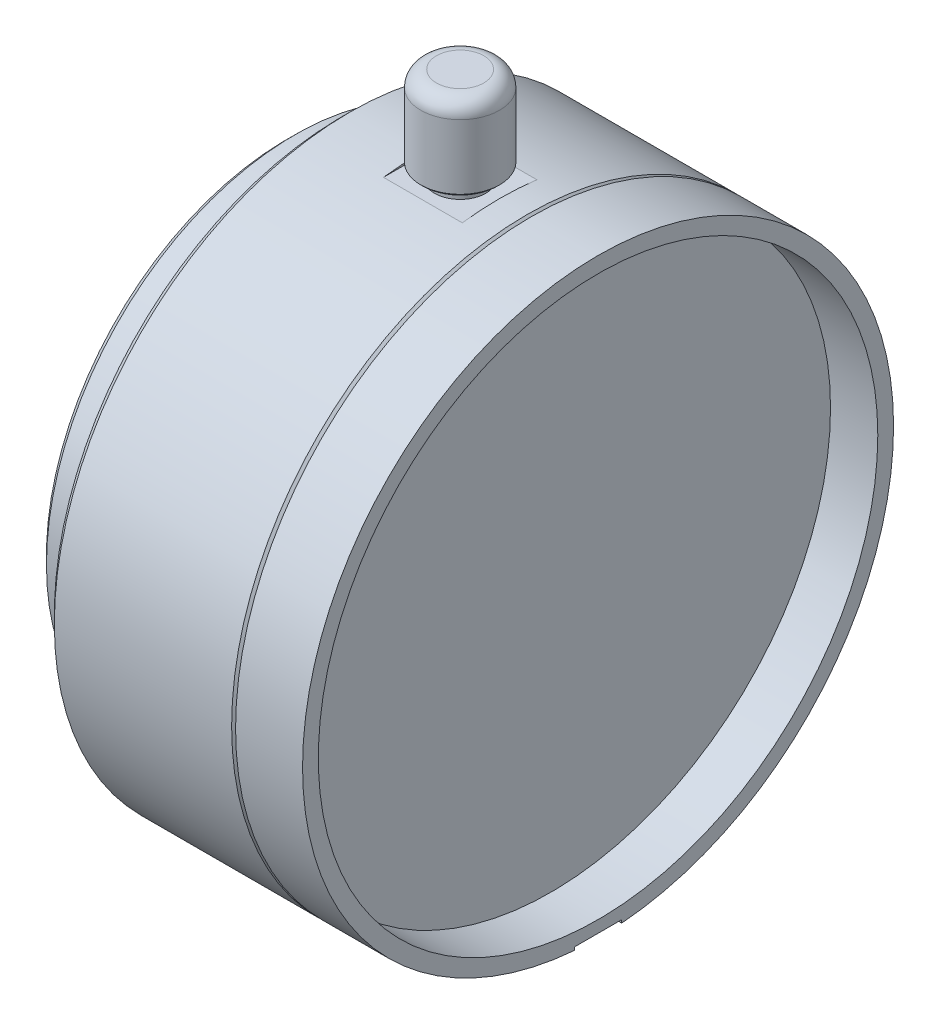
ISO-10303-21;
HEADER;
FILE_DESCRIPTION(('STEP AP214'),'2;1');
FILE_NAME('part.step','',(''),(''),'','','');
FILE_SCHEMA(('AUTOMOTIVE_DESIGN { 1 0 10303 214 1 1 1 1 }'));
ENDSEC;
DATA;
#1=APPLICATION_CONTEXT('core data for automotive mechanical design processes');
#2=APPLICATION_PROTOCOL_DEFINITION('international standard','automotive_design',2000,#1);
#3=PRODUCT_CONTEXT('',#1,'mechanical');
#4=PRODUCT('Part','Part','',(#3));
#5=PRODUCT_RELATED_PRODUCT_CATEGORY('part','',(#4));
#6=PRODUCT_DEFINITION_FORMATION('','',#4);
#7=PRODUCT_DEFINITION_CONTEXT('part definition',#1,'design');
#8=PRODUCT_DEFINITION('design','',#6,#7);
#9=PRODUCT_DEFINITION_SHAPE('','',#8);
#10=(LENGTH_UNIT() NAMED_UNIT(*) SI_UNIT(.MILLI.,.METRE.));
#11=(NAMED_UNIT(*) PLANE_ANGLE_UNIT() SI_UNIT($,.RADIAN.));
#12=(NAMED_UNIT(*) SI_UNIT($,.STERADIAN.) SOLID_ANGLE_UNIT());
#13=UNCERTAINTY_MEASURE_WITH_UNIT(LENGTH_MEASURE(1.E-05),#10,'distance_accuracy_value','');
#14=(GEOMETRIC_REPRESENTATION_CONTEXT(3) GLOBAL_UNCERTAINTY_ASSIGNED_CONTEXT((#13)) GLOBAL_UNIT_ASSIGNED_CONTEXT((#10,
#11,#12)) REPRESENTATION_CONTEXT('',''));
#15=CARTESIAN_POINT('',(0.,0.,0.));
#16=DIRECTION('',(0.,0.,1.));
#17=DIRECTION('',(1.,0.,0.));
#18=AXIS2_PLACEMENT_3D('',#15,#16,#17);
#19=CARTESIAN_POINT('',(3.,0.,0.));
#20=DIRECTION('',(-1.,0.,0.));
#21=DIRECTION('',(0.,0.,1.));
#22=AXIS2_PLACEMENT_3D('',#19,#20,#21);
#23=PLANE('',#22);
#24=CARTESIAN_POINT('',(3.,0.,0.));
#25=DIRECTION('',(-1.,0.,0.));
#26=DIRECTION('',(0.,0.,1.));
#27=AXIS2_PLACEMENT_3D('',#24,#25,#26);
#28=CIRCLE('',#27,15.75);
#29=CARTESIAN_POINT('',(3.,0.,15.75));
#30=VERTEX_POINT('',#29);
#31=EDGE_CURVE('E19',#30,#30,#28,.T.);
#32=ORIENTED_EDGE('',*,*,#31,.T.);
#33=EDGE_LOOP('',(#32));
#34=FACE_BOUND('',#33,.T.);
#35=ADVANCED_FACE('F16',(#34),#23,.T.);
#36=CARTESIAN_POINT('',(3.,25.,0.));
#37=DIRECTION('',(-1.,0.,0.));
#38=DIRECTION('',(0.,0.,1.));
#39=AXIS2_PLACEMENT_3D('',#36,#37,#38);
#40=PLANE('',#39);
#41=CARTESIAN_POINT('',(3.,25.,0.));
#42=DIRECTION('',(-1.,0.,0.));
#43=DIRECTION('',(0.,0.,1.));
#44=AXIS2_PLACEMENT_3D('',#41,#42,#43);
#45=CIRCLE('',#44,3.00000000000001);
#46=CARTESIAN_POINT('',(3.,25.,3.00000000000001));
#47=VERTEX_POINT('',#46);
#48=EDGE_CURVE('E329',#47,#47,#45,.T.);
#49=ORIENTED_EDGE('',*,*,#48,.T.);
#50=EDGE_LOOP('',(#49));
#51=FACE_BOUND('',#50,.T.);
#52=ADVANCED_FACE('F407',(#51),#40,.T.);
#53=CARTESIAN_POINT('',(19.,49.2,0.));
#54=DIRECTION('',(0.,1.,0.));
#55=DIRECTION('',(0.,0.,1.));
#56=AXIS2_PLACEMENT_3D('',#53,#54,#55);
#57=PLANE('',#56);
#58=CARTESIAN_POINT('',(19.,49.2,0.));
#59=DIRECTION('',(0.,-1.,0.));
#60=DIRECTION('',(0.972491776211941,0.,0.232937212999866));
#61=AXIS2_PLACEMENT_3D('',#58,#59,#60);
#62=CIRCLE('',#61,3.);
#63=CARTESIAN_POINT('',(21.9174753286358,49.2,0.698811638999596));
#64=VERTEX_POINT('',#63);
#65=EDGE_CURVE('E125',#64,#64,#62,.T.);
#66=ORIENTED_EDGE('',*,*,#65,.F.);
#67=EDGE_LOOP('',(#66));
#68=FACE_BOUND('',#67,.T.);
#69=ADVANCED_FACE('F341',(#68),#57,.T.);
#70=CARTESIAN_POINT('',(3.,0.,0.));
#71=DIRECTION('',(-1.,0.,0.));
#72=DIRECTION('',(0.,0.,1.));
#73=AXIS2_PLACEMENT_3D('',#70,#71,#72);
#74=CYLINDRICAL_SURFACE('',#73,15.75);
#75=ORIENTED_EDGE('',*,*,#31,.F.);
#76=EDGE_LOOP('',(#75));
#77=FACE_BOUND('',#76,.T.);
#78=CARTESIAN_POINT('',(-2.00000000000003,0.,0.));
#79=DIRECTION('',(-1.,0.,0.));
#80=DIRECTION('',(0.,0.,1.));
#81=AXIS2_PLACEMENT_3D('',#78,#79,#80);
#82=CIRCLE('',#81,15.75);
#83=CARTESIAN_POINT('',(-2.00000000000003,0.,15.75));
#84=VERTEX_POINT('',#83);
#85=EDGE_CURVE('E121',#84,#84,#82,.T.);
#86=ORIENTED_EDGE('',*,*,#85,.T.);
#87=EDGE_LOOP('',(#86));
#88=FACE_BOUND('',#87,.T.);
#89=ADVANCED_FACE('F337',(#77,#88),#74,.F.);
#90=CARTESIAN_POINT('',(5.,17.6776695296638,-17.6776695296636));
#91=DIRECTION('',(-1.,0.,0.));
#92=DIRECTION('',(0.,0.,1.));
#93=AXIS2_PLACEMENT_3D('',#90,#91,#92);
#94=PLANE('',#93);
#95=CARTESIAN_POINT('',(5.,17.6776695296638,-17.6776695296636));
#96=DIRECTION('',(-1.,0.,0.));
#97=DIRECTION('',(0.,0.,1.));
#98=AXIS2_PLACEMENT_3D('',#95,#96,#97);
#99=CIRCLE('',#98,2.5);
#100=CARTESIAN_POINT('',(5.,17.6776695296638,-15.1776695296636));
#101=VERTEX_POINT('',#100);
#102=EDGE_CURVE('E124',#101,#101,#99,.T.);
#103=ORIENTED_EDGE('',*,*,#102,.T.);
#104=EDGE_LOOP('',(#103));
#105=FACE_BOUND('',#104,.T.);
#106=ADVANCED_FACE('F340',(#105),#94,.T.);
#107=CARTESIAN_POINT('',(5.,-17.6776695296637,-17.6776695296637));
#108=DIRECTION('',(-1.,0.,0.));
#109=DIRECTION('',(0.,0.,1.));
#110=AXIS2_PLACEMENT_3D('',#107,#108,#109);
#111=PLANE('',#110);
#112=CARTESIAN_POINT('',(5.,-17.6776695296637,-17.6776695296637));
#113=DIRECTION('',(-1.,0.,0.));
#114=DIRECTION('',(0.,0.,1.));
#115=AXIS2_PLACEMENT_3D('',#112,#113,#114);
#116=CIRCLE('',#115,2.5);
#117=CARTESIAN_POINT('',(5.,-17.6776695296637,-15.1776695296637));
#118=VERTEX_POINT('',#117);
#119=EDGE_CURVE('E325',#118,#118,#116,.T.);
#120=ORIENTED_EDGE('',*,*,#119,.T.);
#121=EDGE_LOOP('',(#120));
#122=FACE_BOUND('',#121,.T.);
#123=ADVANCED_FACE('F395',(#122),#111,.T.);
#124=CARTESIAN_POINT('',(5.,-17.6776695296638,17.6776695296636));
#125=DIRECTION('',(-1.,0.,0.));
#126=DIRECTION('',(0.,0.,1.));
#127=AXIS2_PLACEMENT_3D('',#124,#125,#126);
#128=PLANE('',#127);
#129=CARTESIAN_POINT('',(5.,-17.6776695296638,17.6776695296636));
#130=DIRECTION('',(-1.,0.,0.));
#131=DIRECTION('',(0.,0.,1.));
#132=AXIS2_PLACEMENT_3D('',#129,#130,#131);
#133=CIRCLE('',#132,2.5);
#134=CARTESIAN_POINT('',(5.,-17.6776695296638,20.1776695296636));
#135=VERTEX_POINT('',#134);
#136=EDGE_CURVE('E322',#135,#135,#133,.T.);
#137=ORIENTED_EDGE('',*,*,#136,.T.);
#138=EDGE_LOOP('',(#137));
#139=FACE_BOUND('',#138,.T.);
#140=ADVANCED_FACE('F400',(#139),#128,.T.);
#141=CARTESIAN_POINT('',(5.,17.6776695296638,17.6776695296636));
#142=DIRECTION('',(-1.,0.,0.));
#143=DIRECTION('',(0.,0.,1.));
#144=AXIS2_PLACEMENT_3D('',#141,#142,#143);
#145=PLANE('',#144);
#146=CARTESIAN_POINT('',(5.,17.6776695296638,17.6776695296636));
#147=DIRECTION('',(-1.,0.,0.));
#148=DIRECTION('',(0.,0.,1.));
#149=AXIS2_PLACEMENT_3D('',#146,#147,#148);
#150=CIRCLE('',#149,2.5);
#151=CARTESIAN_POINT('',(5.,17.6776695296638,20.1776695296636));
#152=VERTEX_POINT('',#151);
#153=EDGE_CURVE('E118',#152,#152,#150,.T.);
#154=ORIENTED_EDGE('',*,*,#153,.T.);
#155=EDGE_LOOP('',(#154));
#156=FACE_BOUND('',#155,.T.);
#157=ADVANCED_FACE('F470',(#156),#145,.T.);
#158=CARTESIAN_POINT('',(3.,25.,0.));
#159=DIRECTION('',(-1.,0.,0.));
#160=DIRECTION('',(0.,0.,1.));
#161=AXIS2_PLACEMENT_3D('',#158,#159,#160);
#162=CYLINDRICAL_SURFACE('',#161,3.00000000000001);
#163=ORIENTED_EDGE('',*,*,#48,.F.);
#164=EDGE_LOOP('',(#163));
#165=FACE_BOUND('',#164,.T.);
#166=CARTESIAN_POINT('',(-2.49999999999773,25.,0.));
#167=DIRECTION('',(-1.,0.,0.));
#168=DIRECTION('',(0.,0.,1.));
#169=AXIS2_PLACEMENT_3D('',#166,#167,#168);
#170=CIRCLE('',#169,2.9999999999859);
#171=CARTESIAN_POINT('',(-2.49999999999773,25.,2.9999999999859));
#172=VERTEX_POINT('',#171);
#173=EDGE_CURVE('E115',#172,#172,#170,.T.);
#174=ORIENTED_EDGE('',*,*,#173,.T.);
#175=EDGE_LOOP('',(#174));
#176=FACE_BOUND('',#175,.T.);
#177=ADVANCED_FACE('F479',(#165,#176),#162,.F.);
#178=CARTESIAN_POINT('',(30.5,0.,0.));
#179=DIRECTION('',(1.,0.,0.));
#180=DIRECTION('',(0.,0.,-1.));
#181=AXIS2_PLACEMENT_3D('',#178,#179,#180);
#182=PLANE('',#181);
#183=CARTESIAN_POINT('',(30.5,0.,0.));
#184=DIRECTION('',(1.,0.,0.));
#185=DIRECTION('',(0.,0.,-1.));
#186=AXIS2_PLACEMENT_3D('',#183,#184,#185);
#187=CIRCLE('',#186,35.5);
#188=CARTESIAN_POINT('',(30.5,0.,-35.5));
#189=VERTEX_POINT('',#188);
#190=EDGE_CURVE('E104',#189,#189,#187,.T.);
#191=ORIENTED_EDGE('',*,*,#190,.T.);
#192=EDGE_LOOP('',(#191));
#193=FACE_BOUND('',#192,.T.);
#194=ADVANCED_FACE('F139',(#193),#182,.T.);
#195=CARTESIAN_POINT('',(19.,47.2,0.));
#196=DIRECTION('',(0.,1.,0.));
#197=DIRECTION('',(0.972491776211941,0.,0.232937212999866));
#198=AXIS2_PLACEMENT_3D('',#195,#196,#197);
#199=TOROIDAL_SURFACE('',#198,3.,2.);
#200=ORIENTED_EDGE('',*,*,#65,.T.);
#201=EDGE_LOOP('',(#200));
#202=FACE_BOUND('',#201,.T.);
#203=CARTESIAN_POINT('',(19.,47.2,0.));
#204=DIRECTION('',(0.,-1.,0.));
#205=DIRECTION('',(0.,0.,-1.));
#206=AXIS2_PLACEMENT_3D('',#203,#204,#205);
#207=CIRCLE('',#206,5.);
#208=CARTESIAN_POINT('',(19.,47.2,-5.));
#209=VERTEX_POINT('',#208);
#210=EDGE_CURVE('E100',#209,#209,#207,.T.);
#211=ORIENTED_EDGE('',*,*,#210,.F.);
#212=EDGE_LOOP('',(#211));
#213=FACE_BOUND('',#212,.T.);
#214=ADVANCED_FACE('F133',(#202,#213),#199,.T.);
#215=CARTESIAN_POINT('',(-3.,0.,0.));
#216=DIRECTION('',(-1.,0.,0.));
#217=DIRECTION('',(0.,0.,1.));
#218=AXIS2_PLACEMENT_3D('',#215,#216,#217);
#219=CONICAL_SURFACE('',#218,16.75,0.785398163397455);
#220=ORIENTED_EDGE('',*,*,#85,.F.);
#221=EDGE_LOOP('',(#220));
#222=FACE_BOUND('',#221,.T.);
#223=CARTESIAN_POINT('',(-3.,0.,0.));
#224=DIRECTION('',(-1.,0.,0.));
#225=DIRECTION('',(0.,0.,1.));
#226=AXIS2_PLACEMENT_3D('',#223,#224,#225);
#227=CIRCLE('',#226,16.75);
#228=CARTESIAN_POINT('',(-3.,0.,16.75));
#229=VERTEX_POINT('',#228);
#230=EDGE_CURVE('E103',#229,#229,#227,.T.);
#231=ORIENTED_EDGE('',*,*,#230,.T.);
#232=EDGE_LOOP('',(#231));
#233=FACE_BOUND('',#232,.T.);
#234=ADVANCED_FACE('F138',(#222,#233),#219,.F.);
#235=CARTESIAN_POINT('',(-3.,17.6776695296638,-17.6776695296636));
#236=DIRECTION('',(-1.,0.,0.));
#237=DIRECTION('',(0.,0.,1.));
#238=AXIS2_PLACEMENT_3D('',#235,#236,#237);
#239=CYLINDRICAL_SURFACE('',#238,2.5);
#240=CARTESIAN_POINT('',(-3.,17.6776695296638,-17.6776695296636));
#241=DIRECTION('',(-1.,0.,0.));
#242=DIRECTION('',(0.,0.,1.));
#243=AXIS2_PLACEMENT_3D('',#240,#241,#242);
#244=CIRCLE('',#243,2.5);
#245=CARTESIAN_POINT('',(-3.,17.6776695296638,-15.1776695296636));
#246=VERTEX_POINT('',#245);
#247=EDGE_CURVE('E313',#246,#246,#244,.T.);
#248=ORIENTED_EDGE('',*,*,#247,.T.);
#249=EDGE_LOOP('',(#248));
#250=FACE_BOUND('',#249,.T.);
#251=ORIENTED_EDGE('',*,*,#102,.F.);
#252=EDGE_LOOP('',(#251));
#253=FACE_BOUND('',#252,.T.);
#254=ADVANCED_FACE('F347',(#250,#253),#239,.F.);
#255=CARTESIAN_POINT('',(-3.,-17.6776695296637,-17.6776695296637));
#256=DIRECTION('',(-1.,0.,0.));
#257=DIRECTION('',(0.,0.,1.));
#258=AXIS2_PLACEMENT_3D('',#255,#256,#257);
#259=CYLINDRICAL_SURFACE('',#258,2.5);
#260=CARTESIAN_POINT('',(-3.,-17.6776695296637,-17.6776695296637));
#261=DIRECTION('',(-1.,0.,0.));
#262=DIRECTION('',(0.,0.,1.));
#263=AXIS2_PLACEMENT_3D('',#260,#261,#262);
#264=CIRCLE('',#263,2.5);
#265=CARTESIAN_POINT('',(-3.,-17.6776695296637,-15.1776695296637));
#266=VERTEX_POINT('',#265);
#267=EDGE_CURVE('E310',#266,#266,#264,.T.);
#268=ORIENTED_EDGE('',*,*,#267,.T.);
#269=EDGE_LOOP('',(#268));
#270=FACE_BOUND('',#269,.T.);
#271=ORIENTED_EDGE('',*,*,#119,.F.);
#272=EDGE_LOOP('',(#271));
#273=FACE_BOUND('',#272,.T.);
#274=ADVANCED_FACE('F382',(#270,#273),#259,.F.);
#275=CARTESIAN_POINT('',(-3.,-17.6776695296638,17.6776695296636));
#276=DIRECTION('',(-1.,0.,0.));
#277=DIRECTION('',(0.,0.,1.));
#278=AXIS2_PLACEMENT_3D('',#275,#276,#277);
#279=CYLINDRICAL_SURFACE('',#278,2.5);
#280=CARTESIAN_POINT('',(-3.,-17.6776695296638,17.6776695296636));
#281=DIRECTION('',(-1.,0.,0.));
#282=DIRECTION('',(0.,0.,1.));
#283=AXIS2_PLACEMENT_3D('',#280,#281,#282);
#284=CIRCLE('',#283,2.5);
#285=CARTESIAN_POINT('',(-3.,-17.6776695296638,20.1776695296636));
#286=VERTEX_POINT('',#285);
#287=EDGE_CURVE('E307',#286,#286,#284,.T.);
#288=ORIENTED_EDGE('',*,*,#287,.T.);
#289=EDGE_LOOP('',(#288));
#290=FACE_BOUND('',#289,.T.);
#291=ORIENTED_EDGE('',*,*,#136,.F.);
#292=EDGE_LOOP('',(#291));
#293=FACE_BOUND('',#292,.T.);
#294=ADVANCED_FACE('F378',(#290,#293),#279,.F.);
#295=CARTESIAN_POINT('',(-3.,17.6776695296638,17.6776695296636));
#296=DIRECTION('',(-1.,0.,0.));
#297=DIRECTION('',(0.,0.,1.));
#298=AXIS2_PLACEMENT_3D('',#295,#296,#297);
#299=CYLINDRICAL_SURFACE('',#298,2.5);
#300=CARTESIAN_POINT('',(-3.,17.6776695296638,17.6776695296636));
#301=DIRECTION('',(-1.,0.,0.));
#302=DIRECTION('',(0.,0.,1.));
#303=AXIS2_PLACEMENT_3D('',#300,#301,#302);
#304=CIRCLE('',#303,2.5);
#305=CARTESIAN_POINT('',(-3.,17.6776695296638,20.1776695296636));
#306=VERTEX_POINT('',#305);
#307=EDGE_CURVE('E304',#306,#306,#304,.T.);
#308=ORIENTED_EDGE('',*,*,#307,.T.);
#309=EDGE_LOOP('',(#308));
#310=FACE_BOUND('',#309,.T.);
#311=ORIENTED_EDGE('',*,*,#153,.F.);
#312=EDGE_LOOP('',(#311));
#313=FACE_BOUND('',#312,.T.);
#314=ADVANCED_FACE('F374',(#310,#313),#299,.F.);
#315=CARTESIAN_POINT('',(-2.99999999987222,25.,0.));
#316=DIRECTION('',(-1.,0.,0.));
#317=DIRECTION('',(0.,-1.,0.));
#318=AXIS2_PLACEMENT_3D('',#315,#316,#317);
#319=CONICAL_SURFACE('',#318,3.49999999986039,0.785398163454292);
#320=ORIENTED_EDGE('',*,*,#173,.F.);
#321=EDGE_LOOP('',(#320));
#322=FACE_BOUND('',#321,.T.);
#323=CARTESIAN_POINT('',(-3.00000000004275,25.,0.));
#324=DIRECTION('',(-1.,0.,0.));
#325=DIRECTION('',(0.,-1.,0.));
#326=AXIS2_PLACEMENT_3D('',#323,#324,#325);
#327=CIRCLE('',#326,3.50000000003092);
#328=CARTESIAN_POINT('',(-3.00000000004275,21.4999999999691,0.));
#329=VERTEX_POINT('',#328);
#330=EDGE_CURVE('E301',#329,#329,#327,.T.);
#331=ORIENTED_EDGE('',*,*,#330,.T.);
#332=EDGE_LOOP('',(#331));
#333=FACE_BOUND('',#332,.T.);
#334=ADVANCED_FACE('F370',(#322,#333),#319,.F.);
#335=CARTESIAN_POINT('',(-93.9091629284898,0.,0.));
#336=DIRECTION('',(1.,0.,0.));
#337=DIRECTION('',(0.,0.,-1.));
#338=AXIS2_PLACEMENT_3D('',#335,#336,#337);
#339=CYLINDRICAL_SURFACE('',#338,35.5);
#340=CARTESIAN_POINT('',(36.5,0.,0.));
#341=DIRECTION('',(1.,0.,0.));
#342=DIRECTION('',(0.,0.,-1.));
#343=AXIS2_PLACEMENT_3D('',#340,#341,#342);
#344=CIRCLE('',#343,35.5);
#345=CARTESIAN_POINT('',(36.5,0.,-35.5));
#346=VERTEX_POINT('',#345);
#347=EDGE_CURVE('E86',#346,#346,#344,.F.);
#348=ORIENTED_EDGE('',*,*,#347,.F.);
#349=EDGE_LOOP('',(#348));
#350=FACE_BOUND('',#349,.T.);
#351=ORIENTED_EDGE('',*,*,#190,.F.);
#352=EDGE_LOOP('',(#351));
#353=FACE_BOUND('',#352,.T.);
#354=ADVANCED_FACE('F367',(#350,#353),#339,.F.);
#355=CARTESIAN_POINT('',(33.5,-37.,0.));
#356=DIRECTION('',(0.,1.,0.));
#357=DIRECTION('',(0.,0.,1.));
#358=AXIS2_PLACEMENT_3D('',#355,#356,#357);
#359=PLANE('',#358);
#360=DIRECTION('',(1.,0.,0.));
#361=VECTOR('',#360,1.);
#362=CARTESIAN_POINT('',(33.5,-37.,3.));
#363=LINE('',#362,#361);
#364=CARTESIAN_POINT('',(36.5,-37.,3.));
#365=VERTEX_POINT('',#364);
#366=CARTESIAN_POINT('',(33.5,-37.,3.));
#367=VERTEX_POINT('',#366);
#368=EDGE_CURVE('E64',#365,#367,#363,.F.);
#369=ORIENTED_EDGE('',*,*,#368,.T.);
#370=CARTESIAN_POINT('',(33.5,-37.,0.));
#371=DIRECTION('',(0.,1.,0.));
#372=DIRECTION('',(0.,0.,1.));
#373=AXIS2_PLACEMENT_3D('',#370,#371,#372);
#374=CIRCLE('',#373,3.);
#375=CARTESIAN_POINT('',(33.5,-37.,-3.));
#376=VERTEX_POINT('',#375);
#377=EDGE_CURVE('E71',#367,#376,#374,.F.);
#378=ORIENTED_EDGE('',*,*,#377,.T.);
#379=DIRECTION('',(-1.,0.,0.));
#380=VECTOR('',#379,1.);
#381=CARTESIAN_POINT('',(33.5,-37.,-3.));
#382=LINE('',#381,#380);
#383=CARTESIAN_POINT('',(36.5,-37.,-3.));
#384=VERTEX_POINT('',#383);
#385=EDGE_CURVE('E73',#376,#384,#382,.F.);
#386=ORIENTED_EDGE('',*,*,#385,.T.);
#387=DIRECTION('',(0.,0.,-1.));
#388=VECTOR('',#387,1.);
#389=CARTESIAN_POINT('',(36.5,-37.,0.));
#390=LINE('',#389,#388);
#391=EDGE_CURVE('E68',#365,#384,#390,.T.);
#392=ORIENTED_EDGE('',*,*,#391,.F.);
#393=EDGE_LOOP('',(#369,#378,#386,#392));
#394=FACE_BOUND('',#393,.T.);
#395=ADVANCED_FACE('F74',(#394),#359,.F.);
#396=CARTESIAN_POINT('',(19.,47.2,0.));
#397=DIRECTION('',(0.,-1.,0.));
#398=DIRECTION('',(0.,0.,-1.));
#399=AXIS2_PLACEMENT_3D('',#396,#397,#398);
#400=CYLINDRICAL_SURFACE('',#399,5.);
#401=ORIENTED_EDGE('',*,*,#210,.T.);
#402=EDGE_LOOP('',(#401));
#403=FACE_BOUND('',#402,.T.);
#404=CARTESIAN_POINT('',(19.,38.9999999999304,0.));
#405=DIRECTION('',(0.,1.,0.));
#406=DIRECTION('',(0.972491776212836,0.,0.232937212996126));
#407=AXIS2_PLACEMENT_3D('',#404,#405,#406);
#408=CIRCLE('',#407,5.00000000000538);
#409=CARTESIAN_POINT('',(23.8624588810694,38.9999999999304,1.16468606498188));
#410=VERTEX_POINT('',#409);
#411=EDGE_CURVE('E283',#410,#410,#408,.F.);
#412=ORIENTED_EDGE('',*,*,#411,.F.);
#413=EDGE_LOOP('',(#412));
#414=FACE_BOUND('',#413,.T.);
#415=ADVANCED_FACE('F352',(#403,#414),#400,.T.);
#416=CARTESIAN_POINT('',(-3.,0.,0.));
#417=DIRECTION('',(1.,0.,0.));
#418=DIRECTION('',(0.,0.,-1.));
#419=AXIS2_PLACEMENT_3D('',#416,#417,#418);
#420=PLANE('',#419);
#421=ORIENTED_EDGE('',*,*,#330,.F.);
#422=EDGE_LOOP('',(#421));
#423=FACE_BOUND('',#422,.T.);
#424=ORIENTED_EDGE('',*,*,#307,.F.);
#425=EDGE_LOOP('',(#424));
#426=FACE_BOUND('',#425,.T.);
#427=ORIENTED_EDGE('',*,*,#287,.F.);
#428=EDGE_LOOP('',(#427));
#429=FACE_BOUND('',#428,.T.);
#430=ORIENTED_EDGE('',*,*,#267,.F.);
#431=EDGE_LOOP('',(#430));
#432=FACE_BOUND('',#431,.T.);
#433=ORIENTED_EDGE('',*,*,#247,.F.);
#434=EDGE_LOOP('',(#433));
#435=FACE_BOUND('',#434,.T.);
#436=CARTESIAN_POINT('',(-3.,0.,0.));
#437=DIRECTION('',(1.,0.,0.));
#438=DIRECTION('',(0.,0.,-1.));
#439=AXIS2_PLACEMENT_3D('',#436,#437,#438);
#440=CIRCLE('',#439,30.5);
#441=CARTESIAN_POINT('',(-3.,0.,-30.5));
#442=VERTEX_POINT('',#441);
#443=EDGE_CURVE('E286',#442,#442,#440,.T.);
#444=ORIENTED_EDGE('',*,*,#443,.F.);
#445=EDGE_LOOP('',(#444));
#446=FACE_BOUND('',#445,.T.);
#447=ORIENTED_EDGE('',*,*,#230,.F.);
#448=EDGE_LOOP('',(#447));
#449=FACE_BOUND('',#448,.T.);
#450=ADVANCED_FACE('F350',(#423,#426,#429,#432,#435,#446,#449),#420,.F.);
#451=CARTESIAN_POINT('',(36.5,0.,0.));
#452=DIRECTION('',(1.,0.,0.));
#453=DIRECTION('',(0.,0.,-1.));
#454=AXIS2_PLACEMENT_3D('',#451,#452,#453);
#455=PLANE('',#454);
#456=DIRECTION('',(0.,1.,0.));
#457=VECTOR('',#456,1.);
#458=CARTESIAN_POINT('',(36.5,-103.,3.));
#459=LINE('',#458,#457);
#460=CARTESIAN_POINT('',(36.5,-37.3798073831313,3.));
#461=VERTEX_POINT('',#460);
#462=EDGE_CURVE('E85',#461,#365,#459,.T.);
#463=ORIENTED_EDGE('',*,*,#462,.T.);
#464=ORIENTED_EDGE('',*,*,#391,.T.);
#465=DIRECTION('',(0.,1.,0.));
#466=VECTOR('',#465,1.);
#467=CARTESIAN_POINT('',(36.5,-103.,-3.));
#468=LINE('',#467,#466);
#469=CARTESIAN_POINT('',(36.5,-37.3798073831313,-3.));
#470=VERTEX_POINT('',#469);
#471=EDGE_CURVE('E78',#384,#470,#468,.F.);
#472=ORIENTED_EDGE('',*,*,#471,.T.);
#473=CARTESIAN_POINT('',(36.5,0.,0.));
#474=DIRECTION('',(-1.,0.,0.));
#475=DIRECTION('',(0.,0.,1.));
#476=AXIS2_PLACEMENT_3D('',#473,#474,#475);
#477=CIRCLE('',#476,37.5);
#478=EDGE_CURVE('E195',#461,#470,#477,.T.);
#479=ORIENTED_EDGE('',*,*,#478,.F.);
#480=EDGE_LOOP('',(#463,#464,#472,#479));
#481=FACE_BOUND('',#480,.T.);
#482=ORIENTED_EDGE('',*,*,#347,.T.);
#483=EDGE_LOOP('',(#482));
#484=FACE_BOUND('',#483,.T.);
#485=ADVANCED_FACE('F81',(#481,#484),#455,.T.);
#486=CARTESIAN_POINT('',(33.5,-103.,-3.));
#487=DIRECTION('',(0.,0.,-1.));
#488=DIRECTION('',(-1.,0.,0.));
#489=AXIS2_PLACEMENT_3D('',#486,#487,#488);
#490=PLANE('',#489);
#491=ORIENTED_EDGE('',*,*,#385,.F.);
#492=DIRECTION('',(0.,1.,0.));
#493=VECTOR('',#492,1.);
#494=CARTESIAN_POINT('',(33.5,-103.,-3.));
#495=LINE('',#494,#493);
#496=CARTESIAN_POINT('',(33.5,-37.3798073831313,-3.));
#497=VERTEX_POINT('',#496);
#498=EDGE_CURVE('E93',#376,#497,#495,.F.);
#499=ORIENTED_EDGE('',*,*,#498,.T.);
#500=DIRECTION('',(-1.,0.,0.));
#501=VECTOR('',#500,1.);
#502=CARTESIAN_POINT('',(36.5,-37.3798073831313,-3.));
#503=LINE('',#502,#501);
#504=EDGE_CURVE('E90',#470,#497,#503,.T.);
#505=ORIENTED_EDGE('',*,*,#504,.F.);
#506=ORIENTED_EDGE('',*,*,#471,.F.);
#507=EDGE_LOOP('',(#491,#499,#505,#506));
#508=FACE_BOUND('',#507,.T.);
#509=ADVANCED_FACE('F88',(#508),#490,.F.);
#510=CARTESIAN_POINT('',(33.5,-103.,0.));
#511=DIRECTION('',(0.,1.,0.));
#512=DIRECTION('',(0.,0.,1.));
#513=AXIS2_PLACEMENT_3D('',#510,#511,#512);
#514=CYLINDRICAL_SURFACE('',#513,3.);
#515=ORIENTED_EDGE('',*,*,#377,.F.);
#516=DIRECTION('',(0.,1.,0.));
#517=VECTOR('',#516,1.);
#518=CARTESIAN_POINT('',(33.5,-103.,3.));
#519=LINE('',#518,#517);
#520=CARTESIAN_POINT('',(33.5,-37.3798073831313,3.));
#521=VERTEX_POINT('',#520);
#522=EDGE_CURVE('E108',#367,#521,#519,.F.);
#523=ORIENTED_EDGE('',*,*,#522,.T.);
#524=CARTESIAN_POINT('',(33.5,-37.3798073831313,-3.));
#525=CARTESIAN_POINT('',(33.4157657843951,-37.379804595537,-3.00000824058983));
#526=CARTESIAN_POINT('',(33.3315355857186,-37.3800920532617,-2.99645233913375));
#527=CARTESIAN_POINT('',(33.1636804549033,-37.3812268680601,-2.98227605040351));
#528=CARTESIAN_POINT('',(33.0800554869081,-37.3820741916862,-2.97165608515367));
#529=CARTESIAN_POINT('',(32.9140671002843,-37.3843072198916,-2.9434272308723));
#530=CARTESIAN_POINT('',(32.8317026875619,-37.3856924748106,-2.92582417878503));
#531=CARTESIAN_POINT('',(32.668774536506,-37.3889594371727,-2.88377403832665));
#532=CARTESIAN_POINT('',(32.5882107808368,-37.3908411398341,-2.85932701587563));
#533=CARTESIAN_POINT('',(32.3500080762617,-37.397157616888,-2.77592538045224));
#534=CARTESIAN_POINT('',(32.1957777398803,-37.4022649109561,-2.7068965247869));
#535=CARTESIAN_POINT('',(31.9012013460169,-37.4136928150102,-2.54405287129312));
#536=CARTESIAN_POINT('',(31.7608532410291,-37.4200132456638,-2.4502417361454));
#537=CARTESIAN_POINT('',(31.497570209265,-37.4331723576343,-2.24023851261612));
#538=CARTESIAN_POINT('',(31.3746709752195,-37.4400120585323,-2.12400166426902));
#539=CARTESIAN_POINT('',(31.150096158438,-37.4534303059131,-1.87253318416019));
#540=CARTESIAN_POINT('',(31.0484238073722,-37.4600088125072,-1.73729866534817));
#541=CARTESIAN_POINT('',(30.8690775816975,-37.4721724719229,-1.45146409010031));
#542=CARTESIAN_POINT('',(30.7914352272627,-37.4777563160061,-1.30084419399569));
#543=CARTESIAN_POINT('',(30.6625611292897,-37.4872899150559,-0.988663086416501));
#544=CARTESIAN_POINT('',(30.6113273490926,-37.491239796031,-0.827102719770838));
#545=CARTESIAN_POINT('',(30.5368231497999,-37.4970535745822,-0.497985031314618));
#546=CARTESIAN_POINT('',(30.5134931132232,-37.4989219188583,-0.330441285405782));
#547=CARTESIAN_POINT('',(30.4952744422948,-37.5003771858926,0.00619786422458165));
#548=CARTESIAN_POINT('',(30.5003860149486,-37.4999640920459,0.17529327923063));
#549=CARTESIAN_POINT('',(30.53885759286,-37.4969066208408,0.509822316031611));
#550=CARTESIAN_POINT('',(30.5721526591719,-37.4942673729207,0.675263459367035));
#551=CARTESIAN_POINT('',(30.6659450605329,-37.487060422009,0.998200646114473));
#552=CARTESIAN_POINT('',(30.7264425085933,-37.4824927110055,1.15569665651565));
#553=CARTESIAN_POINT('',(30.8729962812614,-37.4719338523244,1.45848364624161));
#554=CARTESIAN_POINT('',(30.9590822738844,-37.4659410539857,1.60376020579116));
#555=CARTESIAN_POINT('',(31.1543439928693,-37.4532060505447,1.87781948589611));
#556=CARTESIAN_POINT('',(31.2635190852618,-37.4464638660212,2.00660265916306));
#557=CARTESIAN_POINT('',(31.5022083282678,-37.4329663161151,2.24438968102067));
#558=CARTESIAN_POINT('',(31.6317760082009,-37.4262109636067,2.35333979831574));
#559=CARTESIAN_POINT('',(31.9074415084843,-37.4134644460432,2.54798498185927));
#560=CARTESIAN_POINT('',(32.0535444167612,-37.4074735174159,2.6336728625495));
#561=CARTESIAN_POINT('',(32.3581891395046,-37.3969322563979,2.77935557453397));
#562=CARTESIAN_POINT('',(32.5167396895303,-37.3923829471951,2.83933216787089));
#563=CARTESIAN_POINT('',(32.8415848196648,-37.3852547400337,2.93170775590023));
#564=CARTESIAN_POINT('',(33.0078672405242,-37.3826728523263,2.96414860326368));
#565=CARTESIAN_POINT('',(33.2294104195231,-37.3807473123998,2.98826740309255));
#566=CARTESIAN_POINT('',(33.283481907656,-37.3803950455486,2.99266936530235));
#567=CARTESIAN_POINT('',(33.3916948264698,-37.3799253800191,2.99853167323433));
#568=CARTESIAN_POINT('',(33.4458359903856,-37.3798075908765,2.99999690937321));
#569=CARTESIAN_POINT('',(33.5,-37.3798073831313,3.));
#570=B_SPLINE_CURVE_WITH_KNOTS('',3,(#524,#525,#526,#527,#528,#529,#530,#531,#532,#533,#534,
#535,#536,#537,#538,#539,#540,#541,#542,#543,#544,#545,#546,#547,#548,#549,#550,#551,#552,#553,
#554,#555,#556,#557,#558,#559,#560,#561,#562,#563,#564,#565,#566,#567,#568,#569),.UNSPECIFIED.,
.F.,.F.,(4,2,2,2,2,2,2,2,2,2,2,2,2,2,2,2,2,2,2,2,2,2,4),(0.,0.252619927491709,0.505224764211366,
0.757618899833696,1.0100106045173,1.51455372158973,2.01902231172144,2.52450839742926,
3.03007138444192,3.53629473564066,4.0424790404836,4.5475799190042,5.05268447378904,
5.55662835093611,6.06057432172184,6.56510687472778,7.06962557632171,7.57549140241262,
8.08151330993076,8.58789356576122,9.09350276886772,9.25620034559853,9.4186267624685),.UNSPECIFIED.);
#571=EDGE_CURVE('E186',#497,#521,#570,.T.);
#572=ORIENTED_EDGE('',*,*,#571,.F.);
#573=ORIENTED_EDGE('',*,*,#498,.F.);
#574=EDGE_LOOP('',(#515,#523,#572,#573));
#575=FACE_BOUND('',#574,.T.);
#576=ADVANCED_FACE('F197',(#575),#514,.F.);
#577=CARTESIAN_POINT('',(33.5,-103.,3.));
#578=DIRECTION('',(0.,0.,1.));
#579=DIRECTION('',(1.,0.,0.));
#580=AXIS2_PLACEMENT_3D('',#577,#578,#579);
#581=PLANE('',#580);
#582=ORIENTED_EDGE('',*,*,#368,.F.);
#583=ORIENTED_EDGE('',*,*,#462,.F.);
#584=DIRECTION('',(-1.,0.,0.));
#585=VECTOR('',#584,1.);
#586=CARTESIAN_POINT('',(36.5,-37.3798073831313,2.99999999999999));
#587=LINE('',#586,#585);
#588=EDGE_CURVE('E185',#521,#461,#587,.F.);
#589=ORIENTED_EDGE('',*,*,#588,.F.);
#590=ORIENTED_EDGE('',*,*,#522,.F.);
#591=EDGE_LOOP('',(#582,#583,#589,#590));
#592=FACE_BOUND('',#591,.T.);
#593=ADVANCED_FACE('F215',(#592),#581,.F.);
#594=CARTESIAN_POINT('',(19.,38.9999999998736,0.));
#595=DIRECTION('',(0.,1.,0.));
#596=DIRECTION('',(0.,0.,1.));
#597=AXIS2_PLACEMENT_3D('',#594,#595,#596);
#598=CONICAL_SURFACE('',#597,4.99999999989151,0.785398163321872);
#599=ORIENTED_EDGE('',*,*,#411,.T.);
#600=EDGE_LOOP('',(#599));
#601=FACE_BOUND('',#600,.T.);
#602=CARTESIAN_POINT('',(19.,38.6999999999489,0.));
#603=DIRECTION('',(0.,1.,0.));
#604=DIRECTION('',(0.,0.,1.));
#605=AXIS2_PLACEMENT_3D('',#602,#603,#604);
#606=CIRCLE('',#605,4.70000000001216);
#607=CARTESIAN_POINT('',(19.,38.6999999999489,4.70000000001216));
#608=VERTEX_POINT('',#607);
#609=EDGE_CURVE('E182',#608,#608,#606,.T.);
#610=ORIENTED_EDGE('',*,*,#609,.T.);
#611=EDGE_LOOP('',(#610));
#612=FACE_BOUND('',#611,.T.);
#613=ADVANCED_FACE('F212',(#601,#612),#598,.T.);
#614=CARTESIAN_POINT('',(-2.,0.,0.));
#615=DIRECTION('',(1.,0.,0.));
#616=DIRECTION('',(0.,0.,-1.));
#617=AXIS2_PLACEMENT_3D('',#614,#615,#616);
#618=CONICAL_SURFACE('',#617,31.5,0.785398163397452);
#619=CARTESIAN_POINT('',(-2.,0.,0.));
#620=DIRECTION('',(-1.,0.,0.));
#621=DIRECTION('',(0.,0.,1.));
#622=AXIS2_PLACEMENT_3D('',#619,#620,#621);
#623=CIRCLE('',#622,31.5);
#624=CARTESIAN_POINT('',(-2.,0.,31.5));
#625=VERTEX_POINT('',#624);
#626=EDGE_CURVE('E181',#625,#625,#623,.F.);
#627=ORIENTED_EDGE('',*,*,#626,.F.);
#628=EDGE_LOOP('',(#627));
#629=FACE_BOUND('',#628,.T.);
#630=ORIENTED_EDGE('',*,*,#443,.T.);
#631=EDGE_LOOP('',(#630));
#632=FACE_BOUND('',#631,.T.);
#633=ADVANCED_FACE('F207',(#629,#632),#618,.T.);
#634=CARTESIAN_POINT('',(36.5,0.,0.));
#635=DIRECTION('',(-1.,0.,0.));
#636=DIRECTION('',(0.,0.,1.));
#637=AXIS2_PLACEMENT_3D('',#634,#635,#636);
#638=CYLINDRICAL_SURFACE('',#637,37.5);
#639=CARTESIAN_POINT('',(28.,0.,0.));
#640=DIRECTION('',(-1.,0.,0.));
#641=DIRECTION('',(0.,0.,1.));
#642=AXIS2_PLACEMENT_3D('',#639,#640,#641);
#643=CIRCLE('',#642,37.5);
#644=CARTESIAN_POINT('',(28.,0.,37.5));
#645=VERTEX_POINT('',#644);
#646=EDGE_CURVE('E178',#645,#645,#643,.T.);
#647=ORIENTED_EDGE('',*,*,#646,.F.);
#648=EDGE_LOOP('',(#647));
#649=FACE_BOUND('',#648,.T.);
#650=ORIENTED_EDGE('',*,*,#571,.T.);
#651=ORIENTED_EDGE('',*,*,#588,.T.);
#652=ORIENTED_EDGE('',*,*,#478,.T.);
#653=ORIENTED_EDGE('',*,*,#504,.T.);
#654=EDGE_LOOP('',(#650,#651,#652,#653));
#655=FACE_BOUND('',#654,.T.);
#656=ADVANCED_FACE('F201',(#649,#655),#638,.T.);
#657=CARTESIAN_POINT('',(19.,38.7,0.));
#658=DIRECTION('',(0.,1.,0.));
#659=DIRECTION('',(0.,0.,1.));
#660=AXIS2_PLACEMENT_3D('',#657,#658,#659);
#661=PLANE('',#660);
#662=CARTESIAN_POINT('',(19.,38.7,0.));
#663=DIRECTION('',(0.,-1.,0.));
#664=DIRECTION('',(0.,0.,-1.));
#665=AXIS2_PLACEMENT_3D('',#662,#663,#664);
#666=CIRCLE('',#665,3.25);
#667=CARTESIAN_POINT('',(19.,38.7,-3.25));
#668=VERTEX_POINT('',#667);
#669=EDGE_CURVE('E175',#668,#668,#666,.T.);
#670=ORIENTED_EDGE('',*,*,#669,.F.);
#671=EDGE_LOOP('',(#670));
#672=FACE_BOUND('',#671,.T.);
#673=ORIENTED_EDGE('',*,*,#609,.F.);
#674=EDGE_LOOP('',(#673));
#675=FACE_BOUND('',#674,.T.);
#676=ADVANCED_FACE('F206',(#672,#675),#661,.F.);
#677=CARTESIAN_POINT('',(4.,0.,0.));
#678=DIRECTION('',(-1.,0.,0.));
#679=DIRECTION('',(0.,0.,1.));
#680=AXIS2_PLACEMENT_3D('',#677,#678,#679);
#681=CYLINDRICAL_SURFACE('',#680,31.5);
#682=CARTESIAN_POINT('',(4.,0.,0.));
#683=DIRECTION('',(-1.,0.,0.));
#684=DIRECTION('',(0.,0.,1.));
#685=AXIS2_PLACEMENT_3D('',#682,#683,#684);
#686=CIRCLE('',#685,31.5);
#687=CARTESIAN_POINT('',(4.,0.,31.5));
#688=VERTEX_POINT('',#687);
#689=EDGE_CURVE('E172',#688,#688,#686,.T.);
#690=ORIENTED_EDGE('',*,*,#689,.T.);
#691=EDGE_LOOP('',(#690));
#692=FACE_BOUND('',#691,.T.);
#693=ORIENTED_EDGE('',*,*,#626,.T.);
#694=EDGE_LOOP('',(#693));
#695=FACE_BOUND('',#694,.T.);
#696=ADVANCED_FACE('F262',(#692,#695),#681,.T.);
#697=CARTESIAN_POINT('',(28.,0.,0.));
#698=DIRECTION('',(-1.,0.,0.));
#699=DIRECTION('',(0.,0.,1.));
#700=AXIS2_PLACEMENT_3D('',#697,#698,#699);
#701=PLANE('',#700);
#702=ORIENTED_EDGE('',*,*,#646,.T.);
#703=EDGE_LOOP('',(#702));
#704=FACE_BOUND('',#703,.T.);
#705=CARTESIAN_POINT('',(28.,0.,0.));
#706=DIRECTION('',(-1.,0.,0.));
#707=DIRECTION('',(0.,0.,1.));
#708=AXIS2_PLACEMENT_3D('',#705,#706,#707);
#709=CIRCLE('',#708,37.);
#710=CARTESIAN_POINT('',(28.,0.,37.));
#711=VERTEX_POINT('',#710);
#712=EDGE_CURVE('E169',#711,#711,#709,.T.);
#713=ORIENTED_EDGE('',*,*,#712,.F.);
#714=EDGE_LOOP('',(#713));
#715=FACE_BOUND('',#714,.T.);
#716=ADVANCED_FACE('F259',(#704,#715),#701,.T.);
#717=CARTESIAN_POINT('',(19.,31.85,0.));
#718=DIRECTION('',(0.,-1.,0.));
#719=DIRECTION('',(0.,0.,-1.));
#720=AXIS2_PLACEMENT_3D('',#717,#718,#719);
#721=CYLINDRICAL_SURFACE('',#720,3.25);
#722=ORIENTED_EDGE('',*,*,#669,.T.);
#723=EDGE_LOOP('',(#722));
#724=FACE_BOUND('',#723,.T.);
#725=CARTESIAN_POINT('',(19.,37.2,0.));
#726=DIRECTION('',(0.,-1.,0.));
#727=DIRECTION('',(0.,0.,-1.));
#728=AXIS2_PLACEMENT_3D('',#725,#726,#727);
#729=CIRCLE('',#728,3.25);
#730=CARTESIAN_POINT('',(19.,37.2,-3.25));
#731=VERTEX_POINT('',#730);
#732=EDGE_CURVE('E165',#731,#731,#729,.T.);
#733=ORIENTED_EDGE('',*,*,#732,.F.);
#734=EDGE_LOOP('',(#733));
#735=FACE_BOUND('',#734,.T.);
#736=ADVANCED_FACE('F255',(#724,#735),#721,.T.);
#737=CARTESIAN_POINT('',(4.,0.,0.));
#738=DIRECTION('',(1.,0.,0.));
#739=DIRECTION('',(0.,0.,-1.));
#740=AXIS2_PLACEMENT_3D('',#737,#738,#739);
#741=PLANE('',#740);
#742=ORIENTED_EDGE('',*,*,#689,.F.);
#743=EDGE_LOOP('',(#742));
#744=FACE_BOUND('',#743,.T.);
#745=CARTESIAN_POINT('',(4.,0.,0.));
#746=DIRECTION('',(1.,0.,0.));
#747=DIRECTION('',(0.,0.,-1.));
#748=AXIS2_PLACEMENT_3D('',#745,#746,#747);
#749=CIRCLE('',#748,36.5);
#750=CARTESIAN_POINT('',(4.,0.,-36.5));
#751=VERTEX_POINT('',#750);
#752=EDGE_CURVE('E161',#751,#751,#749,.T.);
#753=ORIENTED_EDGE('',*,*,#752,.F.);
#754=EDGE_LOOP('',(#753));
#755=FACE_BOUND('',#754,.T.);
#756=ADVANCED_FACE('F251',(#744,#755),#741,.F.);
#757=CARTESIAN_POINT('',(27.5,0.,0.));
#758=DIRECTION('',(-1.,0.,0.));
#759=DIRECTION('',(0.,0.,1.));
#760=AXIS2_PLACEMENT_3D('',#757,#758,#759);
#761=CONICAL_SURFACE('',#760,37.5,0.785398163397445);
#762=ORIENTED_EDGE('',*,*,#712,.T.);
#763=EDGE_LOOP('',(#762));
#764=FACE_BOUND('',#763,.T.);
#765=CARTESIAN_POINT('',(27.5,0.,0.));
#766=DIRECTION('',(-1.,0.,0.));
#767=DIRECTION('',(0.,0.,1.));
#768=AXIS2_PLACEMENT_3D('',#765,#766,#767);
#769=CIRCLE('',#768,37.5);
#770=CARTESIAN_POINT('',(27.5,0.,37.5));
#771=VERTEX_POINT('',#770);
#772=EDGE_CURVE('E164',#771,#771,#769,.T.);
#773=ORIENTED_EDGE('',*,*,#772,.F.);
#774=EDGE_LOOP('',(#773));
#775=FACE_BOUND('',#774,.T.);
#776=ADVANCED_FACE('F247',(#764,#775),#761,.T.);
#777=CARTESIAN_POINT('',(24.,37.5,31.));
#778=DIRECTION('',(1.,0.,0.));
#779=DIRECTION('',(0.,0.,-1.));
#780=AXIS2_PLACEMENT_3D('',#777,#778,#779);
#781=PLANE('',#780);
#782=CARTESIAN_POINT('',(24.,0.,0.));
#783=DIRECTION('',(-1.,0.,0.));
#784=DIRECTION('',(0.,0.,1.));
#785=AXIS2_PLACEMENT_3D('',#782,#783,#784);
#786=CIRCLE('',#785,37.5);
#787=CARTESIAN_POINT('',(24.,37.2,-4.73392015141778));
#788=VERTEX_POINT('',#787);
#789=CARTESIAN_POINT('',(24.,37.2,4.73392015141781));
#790=VERTEX_POINT('',#789);
#791=EDGE_CURVE('E157',#788,#790,#786,.F.);
#792=ORIENTED_EDGE('',*,*,#791,.F.);
#793=DIRECTION('',(0.,0.,1.));
#794=VECTOR('',#793,1.);
#795=CARTESIAN_POINT('',(24.,37.2,31.));
#796=LINE('',#795,#794);
#797=EDGE_CURVE('E168',#790,#788,#796,.F.);
#798=ORIENTED_EDGE('',*,*,#797,.F.);
#799=EDGE_LOOP('',(#792,#798));
#800=FACE_BOUND('',#799,.T.);
#801=ADVANCED_FACE('F243',(#800),#781,.F.);
#802=CARTESIAN_POINT('',(14.,37.2,31.));
#803=DIRECTION('',(0.,1.,0.));
#804=DIRECTION('',(-1.,0.,0.));
#805=AXIS2_PLACEMENT_3D('',#802,#803,#804);
#806=PLANE('',#805);
#807=ORIENTED_EDGE('',*,*,#732,.T.);
#808=EDGE_LOOP('',(#807));
#809=FACE_BOUND('',#808,.T.);
#810=DIRECTION('',(-1.,0.,0.));
#811=VECTOR('',#810,1.);
#812=CARTESIAN_POINT('',(38.,37.2,4.73392015141781));
#813=LINE('',#812,#811);
#814=CARTESIAN_POINT('',(14.,37.2,4.73392015141783));
#815=VERTEX_POINT('',#814);
#816=EDGE_CURVE('E156',#790,#815,#813,.T.);
#817=ORIENTED_EDGE('',*,*,#816,.F.);
#818=ORIENTED_EDGE('',*,*,#797,.T.);
#819=DIRECTION('',(-1.,0.,0.));
#820=VECTOR('',#819,1.);
#821=CARTESIAN_POINT('',(38.,37.2,-4.73392015141774));
#822=LINE('',#821,#820);
#823=CARTESIAN_POINT('',(14.,37.2,-4.7339201514178));
#824=VERTEX_POINT('',#823);
#825=EDGE_CURVE('E160',#824,#788,#822,.F.);
#826=ORIENTED_EDGE('',*,*,#825,.F.);
#827=DIRECTION('',(0.,0.,1.));
#828=VECTOR('',#827,1.);
#829=CARTESIAN_POINT('',(14.,37.2,31.));
#830=LINE('',#829,#828);
#831=EDGE_CURVE('E34',#815,#824,#830,.F.);
#832=ORIENTED_EDGE('',*,*,#831,.F.);
#833=EDGE_LOOP('',(#817,#818,#826,#832));
#834=FACE_BOUND('',#833,.T.);
#835=ADVANCED_FACE('F239',(#809,#834),#806,.T.);
#836=CARTESIAN_POINT('',(14.,37.5,31.));
#837=DIRECTION('',(1.,0.,0.));
#838=DIRECTION('',(0.,1.,0.));
#839=AXIS2_PLACEMENT_3D('',#836,#837,#838);
#840=PLANE('',#839);
#841=CARTESIAN_POINT('',(14.,0.,0.));
#842=DIRECTION('',(-1.,0.,0.));
#843=DIRECTION('',(0.,0.,1.));
#844=AXIS2_PLACEMENT_3D('',#841,#842,#843);
#845=CIRCLE('',#844,37.5);
#846=EDGE_CURVE('E25',#815,#824,#845,.T.);
#847=ORIENTED_EDGE('',*,*,#846,.F.);
#848=ORIENTED_EDGE('',*,*,#831,.T.);
#849=EDGE_LOOP('',(#847,#848));
#850=FACE_BOUND('',#849,.T.);
#851=ADVANCED_FACE('F232',(#850),#840,.T.);
#852=CARTESIAN_POINT('',(5.,0.,0.));
#853=DIRECTION('',(1.,0.,0.));
#854=DIRECTION('',(0.,0.,-1.));
#855=AXIS2_PLACEMENT_3D('',#852,#853,#854);
#856=CONICAL_SURFACE('',#855,37.5,0.785398163397452);
#857=CARTESIAN_POINT('',(5.,0.,0.));
#858=DIRECTION('',(-1.,0.,0.));
#859=DIRECTION('',(0.,0.,1.));
#860=AXIS2_PLACEMENT_3D('',#857,#858,#859);
#861=CIRCLE('',#860,37.5);
#862=CARTESIAN_POINT('',(5.,0.,37.5));
#863=VERTEX_POINT('',#862);
#864=EDGE_CURVE('E11',#863,#863,#861,.F.);
#865=ORIENTED_EDGE('',*,*,#864,.F.);
#866=EDGE_LOOP('',(#865));
#867=FACE_BOUND('',#866,.T.);
#868=ORIENTED_EDGE('',*,*,#752,.T.);
#869=EDGE_LOOP('',(#868));
#870=FACE_BOUND('',#869,.T.);
#871=ADVANCED_FACE('F226',(#867,#870),#856,.T.);
#872=CARTESIAN_POINT('',(38.,0.,0.));
#873=DIRECTION('',(-1.,0.,0.));
#874=DIRECTION('',(0.,0.,1.));
#875=AXIS2_PLACEMENT_3D('',#872,#873,#874);
#876=CYLINDRICAL_SURFACE('',#875,37.5);
#877=ORIENTED_EDGE('',*,*,#864,.T.);
#878=EDGE_LOOP('',(#877));
#879=FACE_BOUND('',#878,.T.);
#880=ORIENTED_EDGE('',*,*,#816,.T.);
#881=ORIENTED_EDGE('',*,*,#846,.T.);
#882=ORIENTED_EDGE('',*,*,#825,.T.);
#883=ORIENTED_EDGE('',*,*,#791,.T.);
#884=EDGE_LOOP('',(#880,#881,#882,#883));
#885=FACE_BOUND('',#884,.T.);
#886=ORIENTED_EDGE('',*,*,#772,.T.);
#887=EDGE_LOOP('',(#886));
#888=FACE_BOUND('',#887,.T.);
#889=ADVANCED_FACE('F224',(#879,#885,#888),#876,.T.);
#890=CLOSED_SHELL('',(#35,#52,#69,#89,#106,#123,#140,#157,#177,#194,#214,#234,#254,#274,#294,
#314,#334,#354,#395,#415,#450,#485,#509,#576,#593,#613,#633,#656,#676,#696,#716,#736,#756,#776,
#801,#835,#851,#871,#889));
#891=MANIFOLD_SOLID_BREP('B1',#890);
#892=ADVANCED_BREP_SHAPE_REPRESENTATION('',(#18,#891),#14);
#893=SHAPE_DEFINITION_REPRESENTATION(#9,#892);
ENDSEC;
END-ISO-10303-21;
